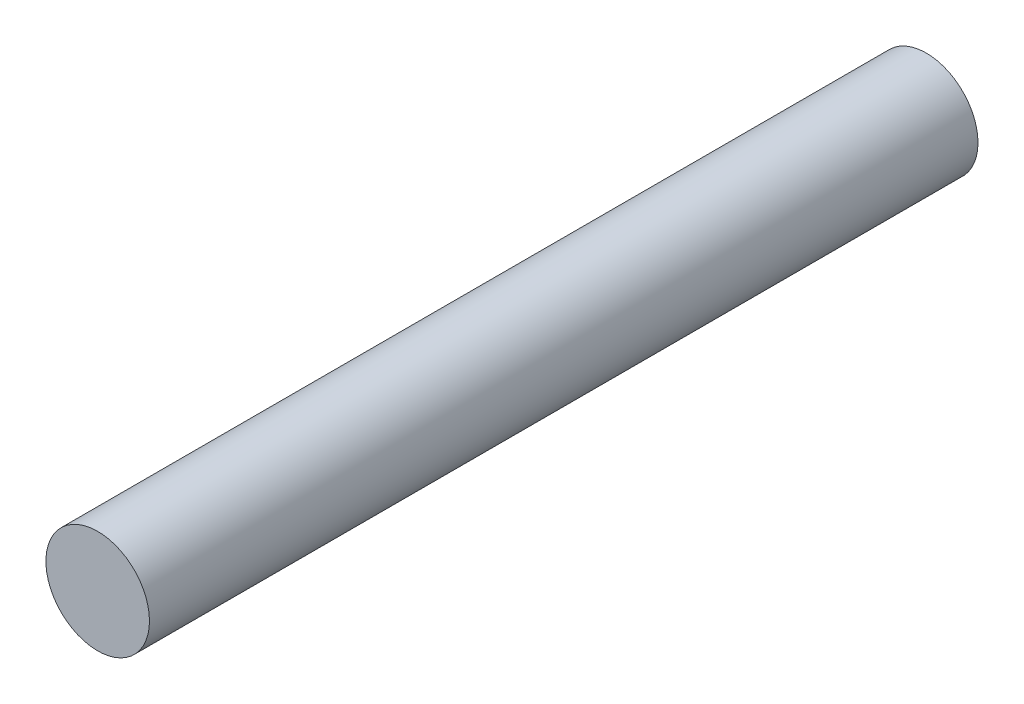
ISO-10303-21;
HEADER;
FILE_DESCRIPTION(('STEP AP214'),'2;1');
FILE_NAME('part.step','',(''),(''),'','','');
FILE_SCHEMA(('AUTOMOTIVE_DESIGN { 1 0 10303 214 1 1 1 1 }'));
ENDSEC;
DATA;
#1=APPLICATION_CONTEXT('core data for automotive mechanical design processes');
#2=APPLICATION_PROTOCOL_DEFINITION('international standard','automotive_design',2000,#1);
#3=PRODUCT_CONTEXT('',#1,'mechanical');
#4=PRODUCT('Part','Part','',(#3));
#5=PRODUCT_RELATED_PRODUCT_CATEGORY('part','',(#4));
#6=PRODUCT_DEFINITION_FORMATION('','',#4);
#7=PRODUCT_DEFINITION_CONTEXT('part definition',#1,'design');
#8=PRODUCT_DEFINITION('design','',#6,#7);
#9=PRODUCT_DEFINITION_SHAPE('','',#8);
#10=(LENGTH_UNIT() NAMED_UNIT(*) SI_UNIT(.MILLI.,.METRE.));
#11=(NAMED_UNIT(*) PLANE_ANGLE_UNIT() SI_UNIT($,.RADIAN.));
#12=(NAMED_UNIT(*) SI_UNIT($,.STERADIAN.) SOLID_ANGLE_UNIT());
#13=UNCERTAINTY_MEASURE_WITH_UNIT(LENGTH_MEASURE(1.E-05),#10,'distance_accuracy_value','');
#14=(GEOMETRIC_REPRESENTATION_CONTEXT(3) GLOBAL_UNCERTAINTY_ASSIGNED_CONTEXT((#13)) GLOBAL_UNIT_ASSIGNED_CONTEXT((#10,
#11,#12)) REPRESENTATION_CONTEXT('',''));
#15=CARTESIAN_POINT('',(0.,0.,0.));
#16=DIRECTION('',(0.,0.,1.));
#17=DIRECTION('',(1.,0.,0.));
#18=AXIS2_PLACEMENT_3D('',#15,#16,#17);
#19=CARTESIAN_POINT('',(0.,0.,16.));
#20=DIRECTION('',(0.,0.,-1.));
#21=DIRECTION('',(-1.,0.,0.));
#22=AXIS2_PLACEMENT_3D('',#19,#20,#21);
#23=CYLINDRICAL_SURFACE('',#22,1.);
#24=CARTESIAN_POINT('',(0.,0.,16.));
#25=DIRECTION('',(0.,0.,1.));
#26=DIRECTION('',(1.,0.,0.));
#27=AXIS2_PLACEMENT_3D('',#24,#25,#26);
#28=CIRCLE('',#27,1.);
#29=CARTESIAN_POINT('',(1.,0.,16.));
#30=VERTEX_POINT('',#29);
#31=EDGE_CURVE('E10',#30,#30,#28,.T.);
#32=ORIENTED_EDGE('',*,*,#31,.F.);
#33=EDGE_LOOP('',(#32));
#34=FACE_BOUND('',#33,.T.);
#35=CARTESIAN_POINT('',(0.,0.,0.));
#36=DIRECTION('',(0.,0.,1.));
#37=DIRECTION('',(1.,0.,0.));
#38=AXIS2_PLACEMENT_3D('',#35,#36,#37);
#39=CIRCLE('',#38,1.);
#40=CARTESIAN_POINT('',(1.,0.,0.));
#41=VERTEX_POINT('',#40);
#42=EDGE_CURVE('E38',#41,#41,#39,.T.);
#43=ORIENTED_EDGE('',*,*,#42,.T.);
#44=EDGE_LOOP('',(#43));
#45=FACE_BOUND('',#44,.T.);
#46=ADVANCED_FACE('F35',(#34,#45),#23,.T.);
#47=CARTESIAN_POINT('',(0.,0.,16.));
#48=DIRECTION('',(0.,0.,1.));
#49=DIRECTION('',(1.,0.,0.));
#50=AXIS2_PLACEMENT_3D('',#47,#48,#49);
#51=PLANE('',#50);
#52=ORIENTED_EDGE('',*,*,#31,.T.);
#53=EDGE_LOOP('',(#52));
#54=FACE_BOUND('',#53,.T.);
#55=ADVANCED_FACE('F50',(#54),#51,.T.);
#56=CARTESIAN_POINT('',(0.,0.,0.));
#57=DIRECTION('',(0.,0.,1.));
#58=DIRECTION('',(1.,0.,0.));
#59=AXIS2_PLACEMENT_3D('',#56,#57,#58);
#60=PLANE('',#59);
#61=ORIENTED_EDGE('',*,*,#42,.F.);
#62=EDGE_LOOP('',(#61));
#63=FACE_BOUND('',#62,.T.);
#64=ADVANCED_FACE('F48',(#63),#60,.F.);
#65=CLOSED_SHELL('',(#46,#55,#64));
#66=MANIFOLD_SOLID_BREP('B2',#65);
#67=ADVANCED_BREP_SHAPE_REPRESENTATION('',(#18,#66),#14);
#68=SHAPE_DEFINITION_REPRESENTATION(#9,#67);
ENDSEC;
END-ISO-10303-21;
